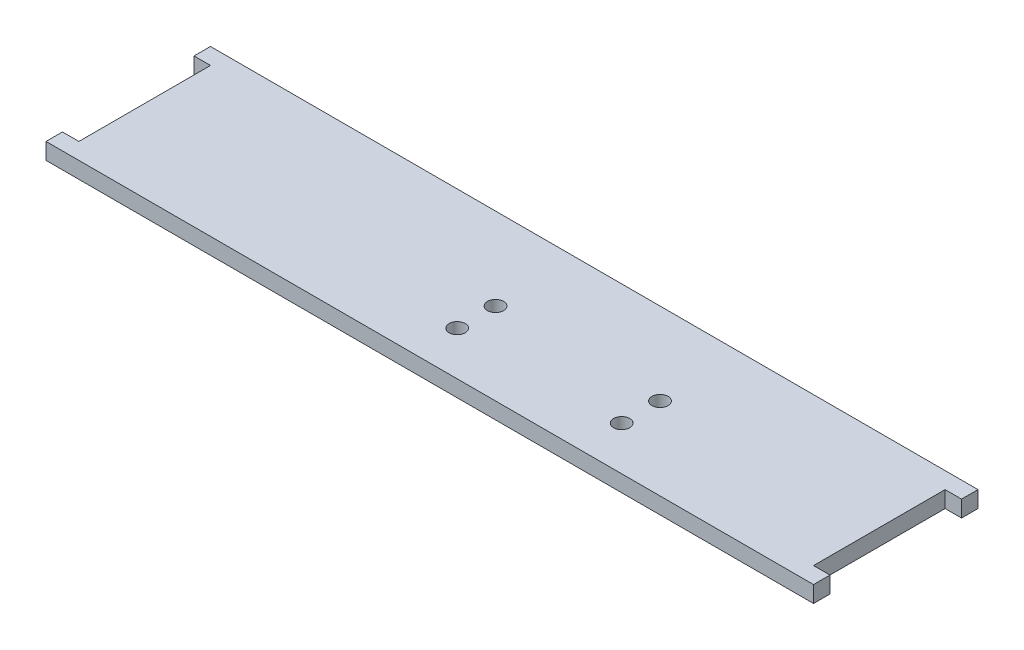
ISO-10303-21;
HEADER;
FILE_DESCRIPTION(('STEP AP214'),'2;1');
FILE_NAME('part.step','',(''),(''),'','','');
FILE_SCHEMA(('AUTOMOTIVE_DESIGN { 1 0 10303 214 1 1 1 1 }'));
ENDSEC;
DATA;
#1=APPLICATION_CONTEXT('core data for automotive mechanical design processes');
#2=APPLICATION_PROTOCOL_DEFINITION('international standard','automotive_design',2000,#1);
#3=PRODUCT_CONTEXT('',#1,'mechanical');
#4=PRODUCT('Part','Part','',(#3));
#5=PRODUCT_RELATED_PRODUCT_CATEGORY('part','',(#4));
#6=PRODUCT_DEFINITION_FORMATION('','',#4);
#7=PRODUCT_DEFINITION_CONTEXT('part definition',#1,'design');
#8=PRODUCT_DEFINITION('design','',#6,#7);
#9=PRODUCT_DEFINITION_SHAPE('','',#8);
#10=(LENGTH_UNIT() NAMED_UNIT(*) SI_UNIT(.MILLI.,.METRE.));
#11=(NAMED_UNIT(*) PLANE_ANGLE_UNIT() SI_UNIT($,.RADIAN.));
#12=(NAMED_UNIT(*) SI_UNIT($,.STERADIAN.) SOLID_ANGLE_UNIT());
#13=UNCERTAINTY_MEASURE_WITH_UNIT(LENGTH_MEASURE(1.E-05),#10,'distance_accuracy_value','');
#14=(GEOMETRIC_REPRESENTATION_CONTEXT(3) GLOBAL_UNCERTAINTY_ASSIGNED_CONTEXT((#13)) GLOBAL_UNIT_ASSIGNED_CONTEXT((#10,
#11,#12)) REPRESENTATION_CONTEXT('',''));
#15=CARTESIAN_POINT('',(0.,0.,0.));
#16=DIRECTION('',(0.,0.,1.));
#17=DIRECTION('',(1.,0.,0.));
#18=AXIS2_PLACEMENT_3D('',#15,#16,#17);
#19=CARTESIAN_POINT('',(70.,3.,15.));
#20=DIRECTION('',(-1.,0.,0.));
#21=DIRECTION('',(0.,0.,1.));
#22=AXIS2_PLACEMENT_3D('',#19,#20,#21);
#23=PLANE('',#22);
#24=DIRECTION('',(0.,0.,-1.));
#25=VECTOR('',#24,1.);
#26=CARTESIAN_POINT('',(70.,0.,15.));
#27=LINE('',#26,#25);
#28=CARTESIAN_POINT('',(70.,0.,15.));
#29=VERTEX_POINT('',#28);
#30=CARTESIAN_POINT('',(70.,0.,12.));
#31=VERTEX_POINT('',#30);
#32=EDGE_CURVE('E155',#29,#31,#27,.T.);
#33=ORIENTED_EDGE('',*,*,#32,.T.);
#34=DIRECTION('',(0.,1.,0.));
#35=VECTOR('',#34,1.);
#36=CARTESIAN_POINT('',(70.,0.,12.));
#37=LINE('',#36,#35);
#38=CARTESIAN_POINT('',(70.,3.,12.));
#39=VERTEX_POINT('',#38);
#40=EDGE_CURVE('E205',#31,#39,#37,.T.);
#41=ORIENTED_EDGE('',*,*,#40,.T.);
#42=DIRECTION('',(0.,0.,-1.));
#43=VECTOR('',#42,1.);
#44=CARTESIAN_POINT('',(70.,3.,15.));
#45=LINE('',#44,#43);
#46=CARTESIAN_POINT('',(70.,3.,15.));
#47=VERTEX_POINT('',#46);
#48=EDGE_CURVE('E221',#47,#39,#45,.T.);
#49=ORIENTED_EDGE('',*,*,#48,.F.);
#50=DIRECTION('',(0.,-1.,0.));
#51=VECTOR('',#50,1.);
#52=CARTESIAN_POINT('',(70.,3.,15.));
#53=LINE('',#52,#51);
#54=EDGE_CURVE('E161',#47,#29,#53,.T.);
#55=ORIENTED_EDGE('',*,*,#54,.T.);
#56=EDGE_LOOP('',(#33,#41,#49,#55));
#57=FACE_BOUND('',#56,.T.);
#58=ADVANCED_FACE('F38',(#57),#23,.F.);
#59=CARTESIAN_POINT('',(-70.,3.,15.));
#60=DIRECTION('',(1.,0.,0.));
#61=DIRECTION('',(0.,0.,-1.));
#62=AXIS2_PLACEMENT_3D('',#59,#60,#61);
#63=PLANE('',#62);
#64=DIRECTION('',(0.,0.,1.));
#65=VECTOR('',#64,1.);
#66=CARTESIAN_POINT('',(-70.,0.,15.));
#67=LINE('',#66,#65);
#68=CARTESIAN_POINT('',(-70.,0.,-15.));
#69=VERTEX_POINT('',#68);
#70=CARTESIAN_POINT('',(-70.,0.,-12.));
#71=VERTEX_POINT('',#70);
#72=EDGE_CURVE('E151',#69,#71,#67,.T.);
#73=ORIENTED_EDGE('',*,*,#72,.T.);
#74=DIRECTION('',(0.,1.,0.));
#75=VECTOR('',#74,1.);
#76=CARTESIAN_POINT('',(-70.,0.,-12.));
#77=LINE('',#76,#75);
#78=CARTESIAN_POINT('',(-70.,3.,-12.));
#79=VERTEX_POINT('',#78);
#80=EDGE_CURVE('E191',#71,#79,#77,.T.);
#81=ORIENTED_EDGE('',*,*,#80,.T.);
#82=DIRECTION('',(0.,0.,1.));
#83=VECTOR('',#82,1.);
#84=CARTESIAN_POINT('',(-70.,3.,15.));
#85=LINE('',#84,#83);
#86=CARTESIAN_POINT('',(-70.,3.,-15.));
#87=VERTEX_POINT('',#86);
#88=EDGE_CURVE('E174',#87,#79,#85,.T.);
#89=ORIENTED_EDGE('',*,*,#88,.F.);
#90=DIRECTION('',(0.,-1.,0.));
#91=VECTOR('',#90,1.);
#92=CARTESIAN_POINT('',(-70.,3.,-15.));
#93=LINE('',#92,#91);
#94=EDGE_CURVE('E46',#87,#69,#93,.T.);
#95=ORIENTED_EDGE('',*,*,#94,.T.);
#96=EDGE_LOOP('',(#73,#81,#89,#95));
#97=FACE_BOUND('',#96,.T.);
#98=ADVANCED_FACE('F171',(#97),#63,.F.);
#99=CARTESIAN_POINT('',(70.,3.,-12.));
#100=VERTEX_POINT('',#99);
#101=CARTESIAN_POINT('',(70.,3.,-15.));
#102=VERTEX_POINT('',#101);
#103=EDGE_CURVE('E160',#100,#102,#45,.T.);
#104=ORIENTED_EDGE('',*,*,#103,.F.);
#105=DIRECTION('',(0.,1.,0.));
#106=VECTOR('',#105,1.);
#107=CARTESIAN_POINT('',(70.,0.,-12.));
#108=LINE('',#107,#106);
#109=CARTESIAN_POINT('',(70.,0.,-12.));
#110=VERTEX_POINT('',#109);
#111=EDGE_CURVE('E217',#110,#100,#108,.T.);
#112=ORIENTED_EDGE('',*,*,#111,.F.);
#113=CARTESIAN_POINT('',(70.,0.,-15.));
#114=VERTEX_POINT('',#113);
#115=EDGE_CURVE('E193',#110,#114,#27,.T.);
#116=ORIENTED_EDGE('',*,*,#115,.T.);
#117=DIRECTION('',(0.,-1.,0.));
#118=VECTOR('',#117,1.);
#119=CARTESIAN_POINT('',(70.,3.,-15.));
#120=LINE('',#119,#118);
#121=EDGE_CURVE('E11',#102,#114,#120,.T.);
#122=ORIENTED_EDGE('',*,*,#121,.F.);
#123=EDGE_LOOP('',(#104,#112,#116,#122));
#124=FACE_BOUND('',#123,.T.);
#125=ADVANCED_FACE('F40',(#124),#23,.F.);
#126=CARTESIAN_POINT('',(-70.,3.,-15.));
#127=DIRECTION('',(0.,0.,1.));
#128=DIRECTION('',(1.,0.,0.));
#129=AXIS2_PLACEMENT_3D('',#126,#127,#128);
#130=PLANE('',#129);
#131=DIRECTION('',(-1.,0.,0.));
#132=VECTOR('',#131,1.);
#133=CARTESIAN_POINT('',(-70.,0.,-15.));
#134=LINE('',#133,#132);
#135=EDGE_CURVE('E152',#114,#69,#134,.T.);
#136=ORIENTED_EDGE('',*,*,#135,.T.);
#137=ORIENTED_EDGE('',*,*,#94,.F.);
#138=DIRECTION('',(-1.,0.,0.));
#139=VECTOR('',#138,1.);
#140=CARTESIAN_POINT('',(-70.,3.,-15.));
#141=LINE('',#140,#139);
#142=EDGE_CURVE('E224',#102,#87,#141,.T.);
#143=ORIENTED_EDGE('',*,*,#142,.F.);
#144=ORIENTED_EDGE('',*,*,#121,.T.);
#145=EDGE_LOOP('',(#136,#137,#143,#144));
#146=FACE_BOUND('',#145,.T.);
#147=ADVANCED_FACE('F253',(#146),#130,.F.);
#148=CARTESIAN_POINT('',(-70.,3.,12.));
#149=VERTEX_POINT('',#148);
#150=CARTESIAN_POINT('',(-70.,3.,15.));
#151=VERTEX_POINT('',#150);
#152=EDGE_CURVE('E143',#149,#151,#85,.T.);
#153=ORIENTED_EDGE('',*,*,#152,.F.);
#154=DIRECTION('',(0.,1.,0.));
#155=VECTOR('',#154,1.);
#156=CARTESIAN_POINT('',(-70.,0.,12.));
#157=LINE('',#156,#155);
#158=CARTESIAN_POINT('',(-70.,0.,12.));
#159=VERTEX_POINT('',#158);
#160=EDGE_CURVE('E130',#159,#149,#157,.T.);
#161=ORIENTED_EDGE('',*,*,#160,.F.);
#162=CARTESIAN_POINT('',(-70.,0.,15.));
#163=VERTEX_POINT('',#162);
#164=EDGE_CURVE('E141',#159,#163,#67,.T.);
#165=ORIENTED_EDGE('',*,*,#164,.T.);
#166=DIRECTION('',(0.,-1.,0.));
#167=VECTOR('',#166,1.);
#168=CARTESIAN_POINT('',(-70.,3.,15.));
#169=LINE('',#168,#167);
#170=EDGE_CURVE('E164',#151,#163,#169,.T.);
#171=ORIENTED_EDGE('',*,*,#170,.F.);
#172=EDGE_LOOP('',(#153,#161,#165,#171));
#173=FACE_BOUND('',#172,.T.);
#174=ADVANCED_FACE('F139',(#173),#63,.F.);
#175=CARTESIAN_POINT('',(-70.,3.,15.));
#176=DIRECTION('',(0.,0.,-1.));
#177=DIRECTION('',(-1.,0.,0.));
#178=AXIS2_PLACEMENT_3D('',#175,#176,#177);
#179=PLANE('',#178);
#180=DIRECTION('',(1.,0.,0.));
#181=VECTOR('',#180,1.);
#182=CARTESIAN_POINT('',(-70.,0.,15.));
#183=LINE('',#182,#181);
#184=EDGE_CURVE('E150',#163,#29,#183,.T.);
#185=ORIENTED_EDGE('',*,*,#184,.T.);
#186=ORIENTED_EDGE('',*,*,#54,.F.);
#187=DIRECTION('',(1.,0.,0.));
#188=VECTOR('',#187,1.);
#189=CARTESIAN_POINT('',(-70.,3.,15.));
#190=LINE('',#189,#188);
#191=EDGE_CURVE('E165',#151,#47,#190,.T.);
#192=ORIENTED_EDGE('',*,*,#191,.F.);
#193=ORIENTED_EDGE('',*,*,#170,.T.);
#194=EDGE_LOOP('',(#185,#186,#192,#193));
#195=FACE_BOUND('',#194,.T.);
#196=ADVANCED_FACE('F248',(#195),#179,.F.);
#197=CARTESIAN_POINT('',(0.,3.,0.));
#198=DIRECTION('',(0.,-1.,0.));
#199=DIRECTION('',(0.,0.,-1.));
#200=AXIS2_PLACEMENT_3D('',#197,#198,#199);
#201=PLANE('',#200);
#202=CARTESIAN_POINT('',(-2.99999999999999,3.,7.));
#203=DIRECTION('',(0.,1.,0.));
#204=DIRECTION('',(0.,0.,1.));
#205=AXIS2_PLACEMENT_3D('',#202,#203,#204);
#206=CIRCLE('',#205,1.47);
#207=CARTESIAN_POINT('',(-2.99999999999999,3.,8.47));
#208=VERTEX_POINT('',#207);
#209=EDGE_CURVE('E320',#208,#208,#206,.T.);
#210=ORIENTED_EDGE('',*,*,#209,.F.);
#211=EDGE_LOOP('',(#210));
#212=FACE_BOUND('',#211,.T.);
#213=CARTESIAN_POINT('',(27.,3.,0.));
#214=DIRECTION('',(0.,1.,0.));
#215=DIRECTION('',(0.,0.,1.));
#216=AXIS2_PLACEMENT_3D('',#213,#214,#215);
#217=CIRCLE('',#216,1.47000000000001);
#218=CARTESIAN_POINT('',(27.,3.,1.47000000000001));
#219=VERTEX_POINT('',#218);
#220=EDGE_CURVE('E313',#219,#219,#217,.T.);
#221=ORIENTED_EDGE('',*,*,#220,.F.);
#222=EDGE_LOOP('',(#221));
#223=FACE_BOUND('',#222,.T.);
#224=CARTESIAN_POINT('',(27.,3.,7.));
#225=DIRECTION('',(0.,1.,0.));
#226=DIRECTION('',(0.,0.,1.));
#227=AXIS2_PLACEMENT_3D('',#224,#225,#226);
#228=CIRCLE('',#227,1.47000000000001);
#229=CARTESIAN_POINT('',(27.,3.,8.47000000000001));
#230=VERTEX_POINT('',#229);
#231=EDGE_CURVE('E310',#230,#230,#228,.T.);
#232=ORIENTED_EDGE('',*,*,#231,.F.);
#233=EDGE_LOOP('',(#232));
#234=FACE_BOUND('',#233,.T.);
#235=CARTESIAN_POINT('',(-2.99999999999999,3.,0.));
#236=DIRECTION('',(0.,1.,0.));
#237=DIRECTION('',(0.,0.,1.));
#238=AXIS2_PLACEMENT_3D('',#235,#236,#237);
#239=CIRCLE('',#238,1.47);
#240=CARTESIAN_POINT('',(-2.99999999999999,3.,1.47));
#241=VERTEX_POINT('',#240);
#242=EDGE_CURVE('E319',#241,#241,#239,.T.);
#243=ORIENTED_EDGE('',*,*,#242,.F.);
#244=EDGE_LOOP('',(#243));
#245=FACE_BOUND('',#244,.T.);
#246=ORIENTED_EDGE('',*,*,#88,.T.);
#247=DIRECTION('',(-1.,0.,0.));
#248=VECTOR('',#247,1.);
#249=CARTESIAN_POINT('',(-70.,3.,-12.));
#250=LINE('',#249,#248);
#251=CARTESIAN_POINT('',(-67.,3.,-12.));
#252=VERTEX_POINT('',#251);
#253=EDGE_CURVE('E135',#252,#79,#250,.T.);
#254=ORIENTED_EDGE('',*,*,#253,.F.);
#255=DIRECTION('',(0.,0.,-1.));
#256=VECTOR('',#255,1.);
#257=CARTESIAN_POINT('',(-67.,3.,-12.));
#258=LINE('',#257,#256);
#259=CARTESIAN_POINT('',(-67.,3.,12.));
#260=VERTEX_POINT('',#259);
#261=EDGE_CURVE('E186',#260,#252,#258,.T.);
#262=ORIENTED_EDGE('',*,*,#261,.F.);
#263=DIRECTION('',(1.,0.,0.));
#264=VECTOR('',#263,1.);
#265=CARTESIAN_POINT('',(-67.,3.,12.));
#266=LINE('',#265,#264);
#267=EDGE_CURVE('E184',#149,#260,#266,.T.);
#268=ORIENTED_EDGE('',*,*,#267,.F.);
#269=ORIENTED_EDGE('',*,*,#152,.T.);
#270=ORIENTED_EDGE('',*,*,#191,.T.);
#271=ORIENTED_EDGE('',*,*,#48,.T.);
#272=DIRECTION('',(1.,0.,0.));
#273=VECTOR('',#272,1.);
#274=CARTESIAN_POINT('',(67.,3.,12.));
#275=LINE('',#274,#273);
#276=CARTESIAN_POINT('',(67.,3.,12.));
#277=VERTEX_POINT('',#276);
#278=EDGE_CURVE('E206',#277,#39,#275,.T.);
#279=ORIENTED_EDGE('',*,*,#278,.F.);
#280=DIRECTION('',(0.,0.,1.));
#281=VECTOR('',#280,1.);
#282=CARTESIAN_POINT('',(67.,3.,-12.));
#283=LINE('',#282,#281);
#284=CARTESIAN_POINT('',(67.,3.,-12.));
#285=VERTEX_POINT('',#284);
#286=EDGE_CURVE('E201',#285,#277,#283,.T.);
#287=ORIENTED_EDGE('',*,*,#286,.F.);
#288=DIRECTION('',(-1.,0.,0.));
#289=VECTOR('',#288,1.);
#290=CARTESIAN_POINT('',(70.,3.,-12.));
#291=LINE('',#290,#289);
#292=EDGE_CURVE('E208',#100,#285,#291,.T.);
#293=ORIENTED_EDGE('',*,*,#292,.F.);
#294=ORIENTED_EDGE('',*,*,#103,.T.);
#295=ORIENTED_EDGE('',*,*,#142,.T.);
#296=EDGE_LOOP('',(#246,#254,#262,#268,#269,#270,#271,#279,#287,#293,#294,#295));
#297=FACE_BOUND('',#296,.T.);
#298=ADVANCED_FACE('F241',(#212,#223,#234,#245,#297),#201,.F.);
#299=CARTESIAN_POINT('',(0.,0.,0.));
#300=DIRECTION('',(0.,-1.,0.));
#301=DIRECTION('',(0.,0.,-1.));
#302=AXIS2_PLACEMENT_3D('',#299,#300,#301);
#303=PLANE('',#302);
#304=CARTESIAN_POINT('',(-2.99999999999999,0.,7.));
#305=DIRECTION('',(0.,1.,0.));
#306=DIRECTION('',(0.,0.,1.));
#307=AXIS2_PLACEMENT_3D('',#304,#305,#306);
#308=CIRCLE('',#307,1.47);
#309=CARTESIAN_POINT('',(-2.99999999999999,0.,8.47));
#310=VERTEX_POINT('',#309);
#311=EDGE_CURVE('E316',#310,#310,#308,.T.);
#312=ORIENTED_EDGE('',*,*,#311,.T.);
#313=EDGE_LOOP('',(#312));
#314=FACE_BOUND('',#313,.T.);
#315=CARTESIAN_POINT('',(27.,0.,0.));
#316=DIRECTION('',(0.,1.,0.));
#317=DIRECTION('',(0.,0.,1.));
#318=AXIS2_PLACEMENT_3D('',#315,#316,#317);
#319=CIRCLE('',#318,1.47000000000001);
#320=CARTESIAN_POINT('',(27.,0.,1.47000000000001));
#321=VERTEX_POINT('',#320);
#322=EDGE_CURVE('E323',#321,#321,#319,.T.);
#323=ORIENTED_EDGE('',*,*,#322,.T.);
#324=EDGE_LOOP('',(#323));
#325=FACE_BOUND('',#324,.T.);
#326=CARTESIAN_POINT('',(27.,0.,7.));
#327=DIRECTION('',(0.,1.,0.));
#328=DIRECTION('',(0.,0.,1.));
#329=AXIS2_PLACEMENT_3D('',#326,#327,#328);
#330=CIRCLE('',#329,1.47000000000001);
#331=CARTESIAN_POINT('',(27.,0.,8.47000000000001));
#332=VERTEX_POINT('',#331);
#333=EDGE_CURVE('E307',#332,#332,#330,.T.);
#334=ORIENTED_EDGE('',*,*,#333,.T.);
#335=EDGE_LOOP('',(#334));
#336=FACE_BOUND('',#335,.T.);
#337=CARTESIAN_POINT('',(-2.99999999999999,0.,0.));
#338=DIRECTION('',(0.,1.,0.));
#339=DIRECTION('',(0.,0.,1.));
#340=AXIS2_PLACEMENT_3D('',#337,#338,#339);
#341=CIRCLE('',#340,1.47);
#342=CARTESIAN_POINT('',(-2.99999999999999,0.,1.47));
#343=VERTEX_POINT('',#342);
#344=EDGE_CURVE('E209',#343,#343,#341,.T.);
#345=ORIENTED_EDGE('',*,*,#344,.T.);
#346=EDGE_LOOP('',(#345));
#347=FACE_BOUND('',#346,.T.);
#348=DIRECTION('',(-1.,0.,0.));
#349=VECTOR('',#348,1.);
#350=CARTESIAN_POINT('',(-70.,0.,-12.));
#351=LINE('',#350,#349);
#352=CARTESIAN_POINT('',(-67.,0.,-12.));
#353=VERTEX_POINT('',#352);
#354=EDGE_CURVE('E144',#353,#71,#351,.T.);
#355=ORIENTED_EDGE('',*,*,#354,.T.);
#356=ORIENTED_EDGE('',*,*,#72,.F.);
#357=ORIENTED_EDGE('',*,*,#135,.F.);
#358=ORIENTED_EDGE('',*,*,#115,.F.);
#359=DIRECTION('',(-1.,0.,0.));
#360=VECTOR('',#359,1.);
#361=CARTESIAN_POINT('',(70.,0.,-12.));
#362=LINE('',#361,#360);
#363=CARTESIAN_POINT('',(67.,0.,-12.));
#364=VERTEX_POINT('',#363);
#365=EDGE_CURVE('E200',#110,#364,#362,.T.);
#366=ORIENTED_EDGE('',*,*,#365,.T.);
#367=DIRECTION('',(0.,0.,1.));
#368=VECTOR('',#367,1.);
#369=CARTESIAN_POINT('',(67.,0.,-12.));
#370=LINE('',#369,#368);
#371=CARTESIAN_POINT('',(67.,0.,12.));
#372=VERTEX_POINT('',#371);
#373=EDGE_CURVE('E61',#364,#372,#370,.T.);
#374=ORIENTED_EDGE('',*,*,#373,.T.);
#375=DIRECTION('',(1.,0.,0.));
#376=VECTOR('',#375,1.);
#377=CARTESIAN_POINT('',(67.,0.,12.));
#378=LINE('',#377,#376);
#379=EDGE_CURVE('E197',#372,#31,#378,.T.);
#380=ORIENTED_EDGE('',*,*,#379,.T.);
#381=ORIENTED_EDGE('',*,*,#32,.F.);
#382=ORIENTED_EDGE('',*,*,#184,.F.);
#383=ORIENTED_EDGE('',*,*,#164,.F.);
#384=DIRECTION('',(1.,0.,0.));
#385=VECTOR('',#384,1.);
#386=CARTESIAN_POINT('',(-67.,0.,12.));
#387=LINE('',#386,#385);
#388=CARTESIAN_POINT('',(-67.,0.,12.));
#389=VERTEX_POINT('',#388);
#390=EDGE_CURVE('E126',#159,#389,#387,.T.);
#391=ORIENTED_EDGE('',*,*,#390,.T.);
#392=DIRECTION('',(0.,0.,-1.));
#393=VECTOR('',#392,1.);
#394=CARTESIAN_POINT('',(-67.,0.,-12.));
#395=LINE('',#394,#393);
#396=EDGE_CURVE('E53',#389,#353,#395,.T.);
#397=ORIENTED_EDGE('',*,*,#396,.T.);
#398=EDGE_LOOP('',(#355,#356,#357,#358,#366,#374,#380,#381,#382,#383,#391,#397));
#399=FACE_BOUND('',#398,.T.);
#400=ADVANCED_FACE('F148',(#314,#325,#336,#347,#399),#303,.T.);
#401=CARTESIAN_POINT('',(67.,0.,12.));
#402=DIRECTION('',(0.,0.,1.));
#403=DIRECTION('',(1.,0.,0.));
#404=AXIS2_PLACEMENT_3D('',#401,#402,#403);
#405=PLANE('',#404);
#406=ORIENTED_EDGE('',*,*,#278,.T.);
#407=ORIENTED_EDGE('',*,*,#40,.F.);
#408=ORIENTED_EDGE('',*,*,#379,.F.);
#409=DIRECTION('',(0.,1.,0.));
#410=VECTOR('',#409,1.);
#411=CARTESIAN_POINT('',(67.,0.,12.));
#412=LINE('',#411,#410);
#413=EDGE_CURVE('E187',#372,#277,#412,.T.);
#414=ORIENTED_EDGE('',*,*,#413,.T.);
#415=EDGE_LOOP('',(#406,#407,#408,#414));
#416=FACE_BOUND('',#415,.T.);
#417=ADVANCED_FACE('F244',(#416),#405,.F.);
#418=CARTESIAN_POINT('',(67.,0.,-12.));
#419=DIRECTION('',(-1.,0.,0.));
#420=DIRECTION('',(0.,0.,1.));
#421=AXIS2_PLACEMENT_3D('',#418,#419,#420);
#422=PLANE('',#421);
#423=ORIENTED_EDGE('',*,*,#286,.T.);
#424=ORIENTED_EDGE('',*,*,#413,.F.);
#425=ORIENTED_EDGE('',*,*,#373,.F.);
#426=DIRECTION('',(0.,1.,0.));
#427=VECTOR('',#426,1.);
#428=CARTESIAN_POINT('',(67.,0.,-12.));
#429=LINE('',#428,#427);
#430=EDGE_CURVE('E215',#364,#285,#429,.T.);
#431=ORIENTED_EDGE('',*,*,#430,.T.);
#432=EDGE_LOOP('',(#423,#424,#425,#431));
#433=FACE_BOUND('',#432,.T.);
#434=ADVANCED_FACE('F237',(#433),#422,.F.);
#435=CARTESIAN_POINT('',(70.,0.,-12.));
#436=DIRECTION('',(0.,0.,-1.));
#437=DIRECTION('',(-1.,0.,0.));
#438=AXIS2_PLACEMENT_3D('',#435,#436,#437);
#439=PLANE('',#438);
#440=ORIENTED_EDGE('',*,*,#292,.T.);
#441=ORIENTED_EDGE('',*,*,#430,.F.);
#442=ORIENTED_EDGE('',*,*,#365,.F.);
#443=ORIENTED_EDGE('',*,*,#111,.T.);
#444=EDGE_LOOP('',(#440,#441,#442,#443));
#445=FACE_BOUND('',#444,.T.);
#446=ADVANCED_FACE('F234',(#445),#439,.F.);
#447=CARTESIAN_POINT('',(-70.,0.,-12.));
#448=DIRECTION('',(0.,0.,-1.));
#449=DIRECTION('',(-1.,0.,0.));
#450=AXIS2_PLACEMENT_3D('',#447,#448,#449);
#451=PLANE('',#450);
#452=ORIENTED_EDGE('',*,*,#253,.T.);
#453=ORIENTED_EDGE('',*,*,#80,.F.);
#454=ORIENTED_EDGE('',*,*,#354,.F.);
#455=DIRECTION('',(0.,1.,0.));
#456=VECTOR('',#455,1.);
#457=CARTESIAN_POINT('',(-67.,0.,-12.));
#458=LINE('',#457,#456);
#459=EDGE_CURVE('E194',#353,#252,#458,.T.);
#460=ORIENTED_EDGE('',*,*,#459,.T.);
#461=EDGE_LOOP('',(#452,#453,#454,#460));
#462=FACE_BOUND('',#461,.T.);
#463=ADVANCED_FACE('F252',(#462),#451,.F.);
#464=CARTESIAN_POINT('',(-67.,0.,-12.));
#465=DIRECTION('',(1.,0.,0.));
#466=DIRECTION('',(0.,0.,-1.));
#467=AXIS2_PLACEMENT_3D('',#464,#465,#466);
#468=PLANE('',#467);
#469=ORIENTED_EDGE('',*,*,#261,.T.);
#470=ORIENTED_EDGE('',*,*,#459,.F.);
#471=ORIENTED_EDGE('',*,*,#396,.F.);
#472=DIRECTION('',(0.,1.,0.));
#473=VECTOR('',#472,1.);
#474=CARTESIAN_POINT('',(-67.,0.,12.));
#475=LINE('',#474,#473);
#476=EDGE_CURVE('E132',#389,#260,#475,.T.);
#477=ORIENTED_EDGE('',*,*,#476,.T.);
#478=EDGE_LOOP('',(#469,#470,#471,#477));
#479=FACE_BOUND('',#478,.T.);
#480=ADVANCED_FACE('F251',(#479),#468,.F.);
#481=CARTESIAN_POINT('',(-67.,0.,12.));
#482=DIRECTION('',(0.,0.,1.));
#483=DIRECTION('',(1.,0.,0.));
#484=AXIS2_PLACEMENT_3D('',#481,#482,#483);
#485=PLANE('',#484);
#486=ORIENTED_EDGE('',*,*,#267,.T.);
#487=ORIENTED_EDGE('',*,*,#476,.F.);
#488=ORIENTED_EDGE('',*,*,#390,.F.);
#489=ORIENTED_EDGE('',*,*,#160,.T.);
#490=EDGE_LOOP('',(#486,#487,#488,#489));
#491=FACE_BOUND('',#490,.T.);
#492=ADVANCED_FACE('F129',(#491),#485,.F.);
#493=CARTESIAN_POINT('',(-2.99999999999999,0.,0.));
#494=DIRECTION('',(0.,1.,0.));
#495=DIRECTION('',(0.,0.,1.));
#496=AXIS2_PLACEMENT_3D('',#493,#494,#495);
#497=CYLINDRICAL_SURFACE('',#496,1.47);
#498=ORIENTED_EDGE('',*,*,#344,.F.);
#499=EDGE_LOOP('',(#498));
#500=FACE_BOUND('',#499,.T.);
#501=ORIENTED_EDGE('',*,*,#242,.T.);
#502=EDGE_LOOP('',(#501));
#503=FACE_BOUND('',#502,.T.);
#504=ADVANCED_FACE('F283',(#500,#503),#497,.F.);
#505=CARTESIAN_POINT('',(27.,0.,7.));
#506=DIRECTION('',(0.,1.,0.));
#507=DIRECTION('',(0.,0.,1.));
#508=AXIS2_PLACEMENT_3D('',#505,#506,#507);
#509=CYLINDRICAL_SURFACE('',#508,1.47000000000001);
#510=ORIENTED_EDGE('',*,*,#333,.F.);
#511=EDGE_LOOP('',(#510));
#512=FACE_BOUND('',#511,.T.);
#513=ORIENTED_EDGE('',*,*,#231,.T.);
#514=EDGE_LOOP('',(#513));
#515=FACE_BOUND('',#514,.T.);
#516=ADVANCED_FACE('F290',(#512,#515),#509,.F.);
#517=CARTESIAN_POINT('',(27.,0.,0.));
#518=DIRECTION('',(0.,1.,0.));
#519=DIRECTION('',(0.,0.,1.));
#520=AXIS2_PLACEMENT_3D('',#517,#518,#519);
#521=CYLINDRICAL_SURFACE('',#520,1.47000000000001);
#522=ORIENTED_EDGE('',*,*,#322,.F.);
#523=EDGE_LOOP('',(#522));
#524=FACE_BOUND('',#523,.T.);
#525=ORIENTED_EDGE('',*,*,#220,.T.);
#526=EDGE_LOOP('',(#525));
#527=FACE_BOUND('',#526,.T.);
#528=ADVANCED_FACE('F292',(#524,#527),#521,.F.);
#529=CARTESIAN_POINT('',(-2.99999999999999,0.,7.));
#530=DIRECTION('',(0.,1.,0.));
#531=DIRECTION('',(0.,0.,1.));
#532=AXIS2_PLACEMENT_3D('',#529,#530,#531);
#533=CYLINDRICAL_SURFACE('',#532,1.47);
#534=ORIENTED_EDGE('',*,*,#311,.F.);
#535=EDGE_LOOP('',(#534));
#536=FACE_BOUND('',#535,.T.);
#537=ORIENTED_EDGE('',*,*,#209,.T.);
#538=EDGE_LOOP('',(#537));
#539=FACE_BOUND('',#538,.T.);
#540=ADVANCED_FACE('F295',(#536,#539),#533,.F.);
#541=CLOSED_SHELL('',(#58,#98,#125,#147,#174,#196,#298,#400,#417,#434,#446,#463,#480,#492,#504,
#516,#528,#540));
#542=MANIFOLD_SOLID_BREP('B2',#541);
#543=ADVANCED_BREP_SHAPE_REPRESENTATION('',(#18,#542),#14);
#544=SHAPE_DEFINITION_REPRESENTATION(#9,#543);
ENDSEC;
END-ISO-10303-21;
